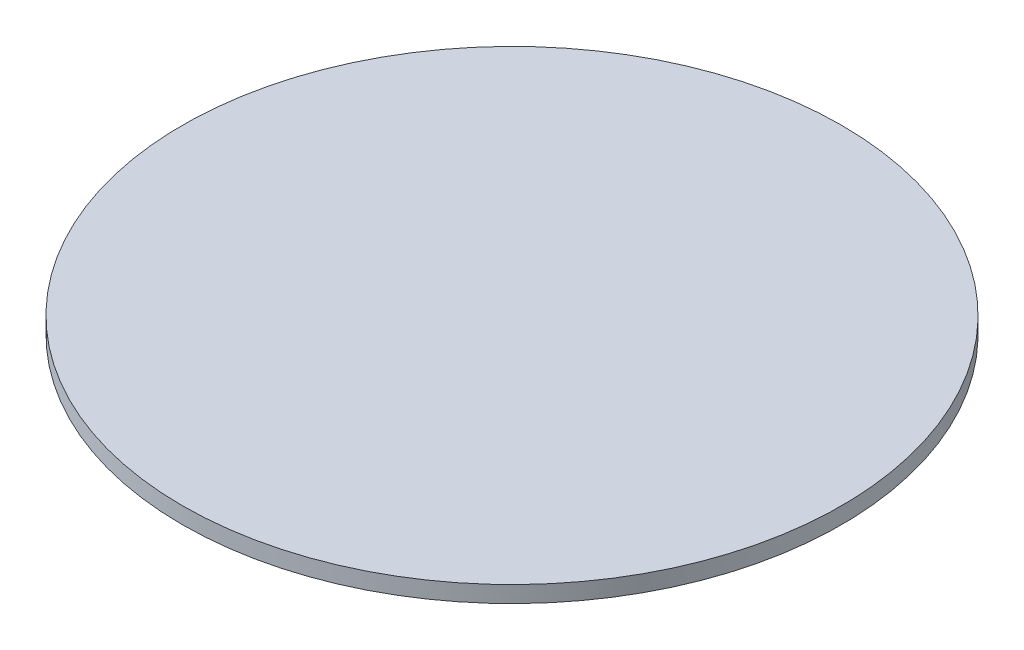
ISO-10303-21;
HEADER;
FILE_DESCRIPTION(('STEP AP214'),'2;1');
FILE_NAME('part.step','',(''),(''),'','','');
FILE_SCHEMA(('AUTOMOTIVE_DESIGN { 1 0 10303 214 1 1 1 1 }'));
ENDSEC;
DATA;
#1=APPLICATION_CONTEXT('core data for automotive mechanical design processes');
#2=APPLICATION_PROTOCOL_DEFINITION('international standard','automotive_design',2000,#1);
#3=PRODUCT_CONTEXT('',#1,'mechanical');
#4=PRODUCT('Part','Part','',(#3));
#5=PRODUCT_RELATED_PRODUCT_CATEGORY('part','',(#4));
#6=PRODUCT_DEFINITION_FORMATION('','',#4);
#7=PRODUCT_DEFINITION_CONTEXT('part definition',#1,'design');
#8=PRODUCT_DEFINITION('design','',#6,#7);
#9=PRODUCT_DEFINITION_SHAPE('','',#8);
#10=(LENGTH_UNIT() NAMED_UNIT(*) SI_UNIT(.MILLI.,.METRE.));
#11=(NAMED_UNIT(*) PLANE_ANGLE_UNIT() SI_UNIT($,.RADIAN.));
#12=(NAMED_UNIT(*) SI_UNIT($,.STERADIAN.) SOLID_ANGLE_UNIT());
#13=UNCERTAINTY_MEASURE_WITH_UNIT(LENGTH_MEASURE(1.E-05),#10,'distance_accuracy_value','');
#14=(GEOMETRIC_REPRESENTATION_CONTEXT(3) GLOBAL_UNCERTAINTY_ASSIGNED_CONTEXT((#13)) GLOBAL_UNIT_ASSIGNED_CONTEXT((#10,
#11,#12)) REPRESENTATION_CONTEXT('',''));
#15=CARTESIAN_POINT('',(0.,0.,0.));
#16=DIRECTION('',(0.,0.,1.));
#17=DIRECTION('',(1.,0.,0.));
#18=AXIS2_PLACEMENT_3D('',#15,#16,#17);
#19=CARTESIAN_POINT('',(0.,1.,0.));
#20=DIRECTION('',(0.,-1.,0.));
#21=DIRECTION('',(0.,0.,-1.));
#22=AXIS2_PLACEMENT_3D('',#19,#20,#21);
#23=CYLINDRICAL_SURFACE('',#22,20.);
#24=CARTESIAN_POINT('',(0.,1.,0.));
#25=DIRECTION('',(0.,1.,0.));
#26=DIRECTION('',(0.,0.,1.));
#27=AXIS2_PLACEMENT_3D('',#24,#25,#26);
#28=CIRCLE('',#27,20.);
#29=CARTESIAN_POINT('',(0.,1.,20.));
#30=VERTEX_POINT('',#29);
#31=EDGE_CURVE('E10',#30,#30,#28,.T.);
#32=ORIENTED_EDGE('',*,*,#31,.F.);
#33=EDGE_LOOP('',(#32));
#34=FACE_BOUND('',#33,.T.);
#35=CARTESIAN_POINT('',(0.,0.,0.));
#36=DIRECTION('',(0.,1.,0.));
#37=DIRECTION('',(0.,0.,1.));
#38=AXIS2_PLACEMENT_3D('',#35,#36,#37);
#39=CIRCLE('',#38,20.);
#40=CARTESIAN_POINT('',(0.,0.,20.));
#41=VERTEX_POINT('',#40);
#42=EDGE_CURVE('E34',#41,#41,#39,.T.);
#43=ORIENTED_EDGE('',*,*,#42,.T.);
#44=EDGE_LOOP('',(#43));
#45=FACE_BOUND('',#44,.T.);
#46=ADVANCED_FACE('F31',(#34,#45),#23,.T.);
#47=CARTESIAN_POINT('',(0.,1.,0.));
#48=DIRECTION('',(0.,1.,0.));
#49=DIRECTION('',(0.,0.,1.));
#50=AXIS2_PLACEMENT_3D('',#47,#48,#49);
#51=PLANE('',#50);
#52=ORIENTED_EDGE('',*,*,#31,.T.);
#53=EDGE_LOOP('',(#52));
#54=FACE_BOUND('',#53,.T.);
#55=ADVANCED_FACE('F46',(#54),#51,.T.);
#56=CARTESIAN_POINT('',(0.,0.,0.));
#57=DIRECTION('',(0.,1.,0.));
#58=DIRECTION('',(0.,0.,1.));
#59=AXIS2_PLACEMENT_3D('',#56,#57,#58);
#60=PLANE('',#59);
#61=ORIENTED_EDGE('',*,*,#42,.F.);
#62=EDGE_LOOP('',(#61));
#63=FACE_BOUND('',#62,.T.);
#64=ADVANCED_FACE('F44',(#63),#60,.F.);
#65=CLOSED_SHELL('',(#46,#55,#64));
#66=MANIFOLD_SOLID_BREP('B2',#65);
#67=ADVANCED_BREP_SHAPE_REPRESENTATION('',(#18,#66),#14);
#68=SHAPE_DEFINITION_REPRESENTATION(#9,#67);
ENDSEC;
END-ISO-10303-21;
